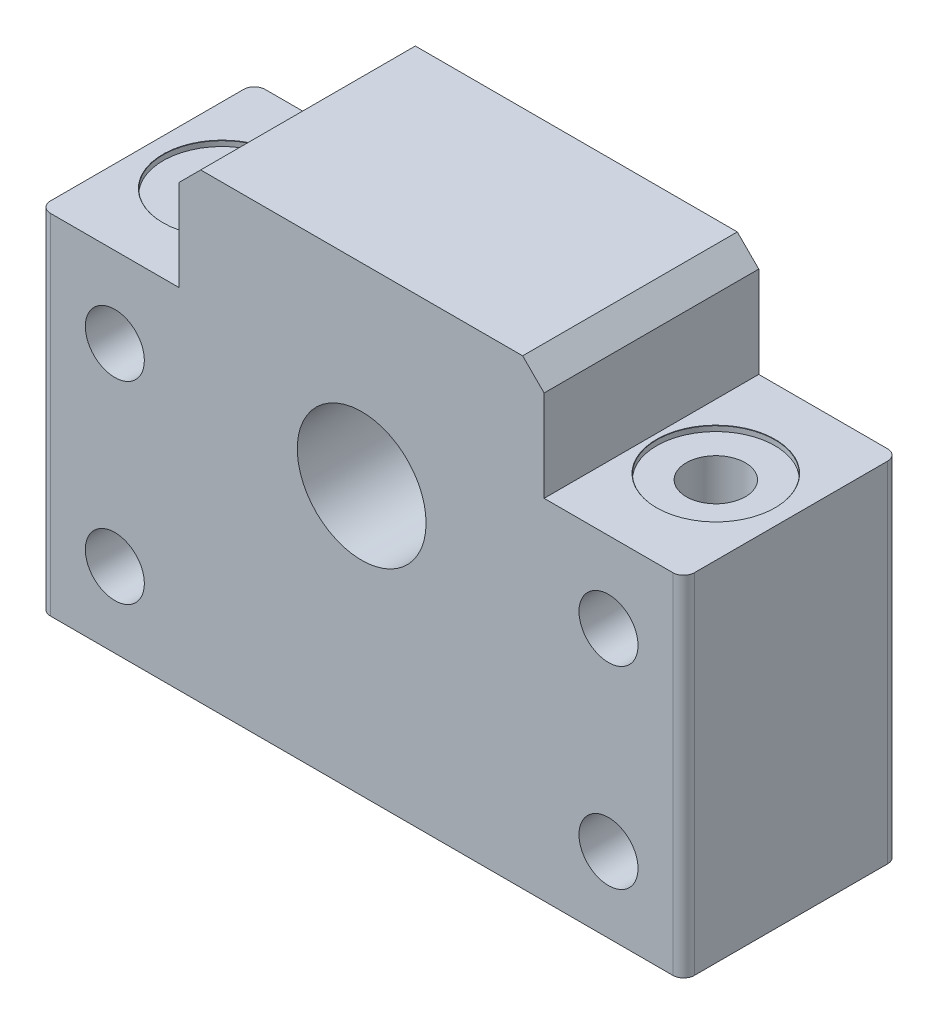
ISO-10303-21;
HEADER;
FILE_DESCRIPTION(('STEP AP214'),'2;1');
FILE_NAME('part.step','',(''),(''),'','','');
FILE_SCHEMA(('AUTOMOTIVE_DESIGN { 1 0 10303 214 1 1 1 1 }'));
ENDSEC;
DATA;
#1=APPLICATION_CONTEXT('core data for automotive mechanical design processes');
#2=APPLICATION_PROTOCOL_DEFINITION('international standard','automotive_design',2000,#1);
#3=PRODUCT_CONTEXT('',#1,'mechanical');
#4=PRODUCT('Part','Part','',(#3));
#5=PRODUCT_RELATED_PRODUCT_CATEGORY('part','',(#4));
#6=PRODUCT_DEFINITION_FORMATION('','',#4);
#7=PRODUCT_DEFINITION_CONTEXT('part definition',#1,'design');
#8=PRODUCT_DEFINITION('design','',#6,#7);
#9=PRODUCT_DEFINITION_SHAPE('','',#8);
#10=(LENGTH_UNIT() NAMED_UNIT(*) SI_UNIT(.MILLI.,.METRE.));
#11=(NAMED_UNIT(*) PLANE_ANGLE_UNIT() SI_UNIT($,.RADIAN.));
#12=(NAMED_UNIT(*) SI_UNIT($,.STERADIAN.) SOLID_ANGLE_UNIT());
#13=UNCERTAINTY_MEASURE_WITH_UNIT(LENGTH_MEASURE(1.E-05),#10,'distance_accuracy_value','');
#14=(GEOMETRIC_REPRESENTATION_CONTEXT(3) GLOBAL_UNCERTAINTY_ASSIGNED_CONTEXT((#13)) GLOBAL_UNIT_ASSIGNED_CONTEXT((#10,
#11,#12)) REPRESENTATION_CONTEXT('',''));
#15=CARTESIAN_POINT('',(0.,0.,0.));
#16=DIRECTION('',(0.,0.,1.));
#17=DIRECTION('',(1.,0.,0.));
#18=AXIS2_PLACEMENT_3D('',#15,#16,#17);
#19=CARTESIAN_POINT('',(23.,8.75,20.));
#20=DIRECTION('',(0.,0.,-1.));
#21=DIRECTION('',(-1.,0.,0.));
#22=AXIS2_PLACEMENT_3D('',#19,#20,#21);
#23=CYLINDRICAL_SURFACE('',#22,2.75);
#24=CARTESIAN_POINT('',(23.,8.75,9.99999999999999));
#25=DIRECTION('',(0.,0.707106781186547,-0.707106781186547));
#26=DIRECTION('',(0.,-0.707106781186547,-0.707106781186547));
#27=AXIS2_PLACEMENT_3D('',#24,#25,#26);
#28=ELLIPSE('',#27,3.88908729652601,2.75);
#29=CARTESIAN_POINT('',(25.75,8.75,9.99999999999999));
#30=VERTEX_POINT('',#29);
#31=CARTESIAN_POINT('',(20.25,8.75,9.99999999999999));
#32=VERTEX_POINT('',#31);
#33=EDGE_CURVE('E345',#30,#32,#28,.F.);
#34=ORIENTED_EDGE('',*,*,#33,.F.);
#35=CARTESIAN_POINT('',(23.,8.75,9.99999999999999));
#36=DIRECTION('',(0.,-0.707106781186547,-0.707106781186547));
#37=DIRECTION('',(0.,0.707106781186547,-0.707106781186547));
#38=AXIS2_PLACEMENT_3D('',#35,#36,#37);
#39=ELLIPSE('',#38,3.88908729652601,2.75);
#40=EDGE_CURVE('E48',#32,#30,#39,.F.);
#41=ORIENTED_EDGE('',*,*,#40,.F.);
#42=EDGE_LOOP('',(#34,#41));
#43=FACE_BOUND('',#42,.T.);
#44=CARTESIAN_POINT('',(23.,8.75,20.));
#45=DIRECTION('',(0.,0.,1.));
#46=DIRECTION('',(-1.,0.,0.));
#47=AXIS2_PLACEMENT_3D('',#44,#45,#46);
#48=CIRCLE('',#47,2.75);
#49=CARTESIAN_POINT('',(20.25,8.75,20.));
#50=VERTEX_POINT('',#49);
#51=EDGE_CURVE('E311',#50,#50,#48,.T.);
#52=ORIENTED_EDGE('',*,*,#51,.T.);
#53=EDGE_LOOP('',(#52));
#54=FACE_BOUND('',#53,.T.);
#55=ADVANCED_FACE('F34',(#43,#54),#23,.F.);
#56=CARTESIAN_POINT('',(23.,-9.25,20.));
#57=DIRECTION('',(0.,0.,-1.));
#58=DIRECTION('',(-1.,0.,0.));
#59=AXIS2_PLACEMENT_3D('',#56,#57,#58);
#60=CYLINDRICAL_SURFACE('',#59,2.75);
#61=CARTESIAN_POINT('',(23.,-9.25,9.99999999999999));
#62=DIRECTION('',(0.,0.707106781186547,-0.707106781186547));
#63=DIRECTION('',(0.,-0.707106781186547,-0.707106781186547));
#64=AXIS2_PLACEMENT_3D('',#61,#62,#63);
#65=ELLIPSE('',#64,3.88908729652601,2.75);
#66=CARTESIAN_POINT('',(25.75,-9.25,9.99999999999999));
#67=VERTEX_POINT('',#66);
#68=CARTESIAN_POINT('',(20.25,-9.25,9.99999999999999));
#69=VERTEX_POINT('',#68);
#70=EDGE_CURVE('E11',#67,#69,#65,.F.);
#71=ORIENTED_EDGE('',*,*,#70,.F.);
#72=CARTESIAN_POINT('',(23.,-9.25,9.99999999999999));
#73=DIRECTION('',(0.,-0.707106781186547,-0.707106781186547));
#74=DIRECTION('',(0.,0.707106781186547,-0.707106781186547));
#75=AXIS2_PLACEMENT_3D('',#72,#73,#74);
#76=ELLIPSE('',#75,3.88908729652601,2.75);
#77=EDGE_CURVE('E55',#69,#67,#76,.F.);
#78=ORIENTED_EDGE('',*,*,#77,.F.);
#79=EDGE_LOOP('',(#71,#78));
#80=FACE_BOUND('',#79,.T.);
#81=CARTESIAN_POINT('',(23.,-9.25,20.));
#82=DIRECTION('',(0.,0.,1.));
#83=DIRECTION('',(-1.,0.,0.));
#84=AXIS2_PLACEMENT_3D('',#81,#82,#83);
#85=CIRCLE('',#84,2.75);
#86=CARTESIAN_POINT('',(20.25,-9.25,20.));
#87=VERTEX_POINT('',#86);
#88=EDGE_CURVE('E305',#87,#87,#85,.T.);
#89=ORIENTED_EDGE('',*,*,#88,.T.);
#90=EDGE_LOOP('',(#89));
#91=FACE_BOUND('',#90,.T.);
#92=ADVANCED_FACE('F170',(#80,#91),#60,.F.);
#93=CARTESIAN_POINT('',(-23.,-9.25000000000001,20.));
#94=DIRECTION('',(0.,0.,-1.));
#95=DIRECTION('',(-1.,0.,0.));
#96=AXIS2_PLACEMENT_3D('',#93,#94,#95);
#97=CYLINDRICAL_SURFACE('',#96,2.75);
#98=CARTESIAN_POINT('',(-23.,-9.25000000000001,10.));
#99=DIRECTION('',(0.,0.707106781186547,-0.707106781186547));
#100=DIRECTION('',(0.,-0.707106781186547,-0.707106781186547));
#101=AXIS2_PLACEMENT_3D('',#98,#99,#100);
#102=ELLIPSE('',#101,3.88908729652601,2.75);
#103=CARTESIAN_POINT('',(-20.25,-9.25000000000001,10.));
#104=VERTEX_POINT('',#103);
#105=CARTESIAN_POINT('',(-25.75,-9.25000000000001,10.));
#106=VERTEX_POINT('',#105);
#107=EDGE_CURVE('E317',#104,#106,#102,.F.);
#108=ORIENTED_EDGE('',*,*,#107,.F.);
#109=CARTESIAN_POINT('',(-23.,-9.25000000000001,10.));
#110=DIRECTION('',(0.,-0.707106781186547,-0.707106781186547));
#111=DIRECTION('',(0.,0.707106781186547,-0.707106781186547));
#112=AXIS2_PLACEMENT_3D('',#109,#110,#111);
#113=ELLIPSE('',#112,3.88908729652601,2.75);
#114=EDGE_CURVE('E327',#106,#104,#113,.F.);
#115=ORIENTED_EDGE('',*,*,#114,.F.);
#116=EDGE_LOOP('',(#108,#115));
#117=FACE_BOUND('',#116,.T.);
#118=CARTESIAN_POINT('',(-23.,-9.25000000000001,20.));
#119=DIRECTION('',(0.,0.,1.));
#120=DIRECTION('',(1.,0.,0.));
#121=AXIS2_PLACEMENT_3D('',#118,#119,#120);
#122=CIRCLE('',#121,2.75);
#123=CARTESIAN_POINT('',(-20.25,-9.25000000000001,20.));
#124=VERTEX_POINT('',#123);
#125=EDGE_CURVE('E299',#124,#124,#122,.T.);
#126=ORIENTED_EDGE('',*,*,#125,.T.);
#127=EDGE_LOOP('',(#126));
#128=FACE_BOUND('',#127,.T.);
#129=ADVANCED_FACE('F431',(#117,#128),#97,.F.);
#130=CARTESIAN_POINT('',(-23.,8.74999999999999,20.));
#131=DIRECTION('',(0.,0.,-1.));
#132=DIRECTION('',(-1.,0.,0.));
#133=AXIS2_PLACEMENT_3D('',#130,#131,#132);
#134=CYLINDRICAL_SURFACE('',#133,2.75);
#135=CARTESIAN_POINT('',(-23.,8.74999999999999,10.));
#136=DIRECTION('',(0.,0.707106781186547,-0.707106781186547));
#137=DIRECTION('',(0.,-0.707106781186547,-0.707106781186547));
#138=AXIS2_PLACEMENT_3D('',#135,#136,#137);
#139=ELLIPSE('',#138,3.88908729652601,2.75);
#140=CARTESIAN_POINT('',(-20.25,8.74999999999999,10.));
#141=VERTEX_POINT('',#140);
#142=CARTESIAN_POINT('',(-25.75,8.74999999999999,10.));
#143=VERTEX_POINT('',#142);
#144=EDGE_CURVE('E168',#141,#143,#139,.F.);
#145=ORIENTED_EDGE('',*,*,#144,.F.);
#146=CARTESIAN_POINT('',(-23.,8.74999999999999,10.));
#147=DIRECTION('',(0.,-0.707106781186547,-0.707106781186547));
#148=DIRECTION('',(0.,0.707106781186547,-0.707106781186547));
#149=AXIS2_PLACEMENT_3D('',#146,#147,#148);
#150=ELLIPSE('',#149,3.88908729652601,2.75);
#151=EDGE_CURVE('E182',#143,#141,#150,.F.);
#152=ORIENTED_EDGE('',*,*,#151,.F.);
#153=EDGE_LOOP('',(#145,#152));
#154=FACE_BOUND('',#153,.T.);
#155=CARTESIAN_POINT('',(-23.,8.74999999999999,20.));
#156=DIRECTION('',(0.,0.,1.));
#157=DIRECTION('',(1.,0.,0.));
#158=AXIS2_PLACEMENT_3D('',#155,#156,#157);
#159=CIRCLE('',#158,2.75);
#160=CARTESIAN_POINT('',(-20.25,8.74999999999999,20.));
#161=VERTEX_POINT('',#160);
#162=EDGE_CURVE('E293',#161,#161,#159,.T.);
#163=ORIENTED_EDGE('',*,*,#162,.T.);
#164=EDGE_LOOP('',(#163));
#165=FACE_BOUND('',#164,.T.);
#166=ADVANCED_FACE('F458',(#154,#165),#134,.F.);
#167=CARTESIAN_POINT('',(0.,0.,20.));
#168=DIRECTION('',(0.,0.,1.));
#169=DIRECTION('',(1.,0.,0.));
#170=AXIS2_PLACEMENT_3D('',#167,#168,#169);
#171=PLANE('',#170);
#172=ORIENTED_EDGE('',*,*,#88,.F.);
#173=EDGE_LOOP('',(#172));
#174=FACE_BOUND('',#173,.T.);
#175=ORIENTED_EDGE('',*,*,#162,.F.);
#176=EDGE_LOOP('',(#175));
#177=FACE_BOUND('',#176,.T.);
#178=DIRECTION('',(-1.,0.,0.));
#179=VECTOR('',#178,1.);
#180=CARTESIAN_POINT('',(-30.,16.25,20.));
#181=LINE('',#180,#179);
#182=CARTESIAN_POINT('',(-17.,16.25,20.));
#183=VERTEX_POINT('',#182);
#184=CARTESIAN_POINT('',(-29.,16.25,20.));
#185=VERTEX_POINT('',#184);
#186=EDGE_CURVE('E278',#183,#185,#181,.T.);
#187=ORIENTED_EDGE('',*,*,#186,.T.);
#188=DIRECTION('',(0.,-1.,0.));
#189=VECTOR('',#188,1.);
#190=CARTESIAN_POINT('',(-29.,-16.25,20.));
#191=LINE('',#190,#189);
#192=CARTESIAN_POINT('',(-29.,-16.25,20.));
#193=VERTEX_POINT('',#192);
#194=EDGE_CURVE('E194',#185,#193,#191,.T.);
#195=ORIENTED_EDGE('',*,*,#194,.T.);
#196=DIRECTION('',(1.,0.,0.));
#197=VECTOR('',#196,1.);
#198=CARTESIAN_POINT('',(-30.,-16.25,20.));
#199=LINE('',#198,#197);
#200=CARTESIAN_POINT('',(29.,-16.25,20.));
#201=VERTEX_POINT('',#200);
#202=EDGE_CURVE('E257',#193,#201,#199,.T.);
#203=ORIENTED_EDGE('',*,*,#202,.T.);
#204=DIRECTION('',(0.,1.,0.));
#205=VECTOR('',#204,1.);
#206=CARTESIAN_POINT('',(29.,16.25,20.));
#207=LINE('',#206,#205);
#208=CARTESIAN_POINT('',(29.,16.25,20.));
#209=VERTEX_POINT('',#208);
#210=EDGE_CURVE('E197',#201,#209,#207,.T.);
#211=ORIENTED_EDGE('',*,*,#210,.T.);
#212=DIRECTION('',(-1.,0.,0.));
#213=VECTOR('',#212,1.);
#214=CARTESIAN_POINT('',(17.,16.25,20.));
#215=LINE('',#214,#213);
#216=CARTESIAN_POINT('',(17.,16.25,20.));
#217=VERTEX_POINT('',#216);
#218=EDGE_CURVE('E261',#209,#217,#215,.T.);
#219=ORIENTED_EDGE('',*,*,#218,.T.);
#220=DIRECTION('',(0.,1.,0.));
#221=VECTOR('',#220,1.);
#222=CARTESIAN_POINT('',(17.,26.75,20.));
#223=LINE('',#222,#221);
#224=CARTESIAN_POINT('',(17.,24.75,20.));
#225=VERTEX_POINT('',#224);
#226=EDGE_CURVE('E286',#217,#225,#223,.T.);
#227=ORIENTED_EDGE('',*,*,#226,.T.);
#228=DIRECTION('',(0.707106781186546,-0.707106781186549,0.));
#229=VECTOR('',#228,1.);
#230=CARTESIAN_POINT('',(20.875,20.875,20.));
#231=LINE('',#230,#229);
#232=CARTESIAN_POINT('',(15.,26.75,20.));
#233=VERTEX_POINT('',#232);
#234=EDGE_CURVE('E225',#225,#233,#231,.F.);
#235=ORIENTED_EDGE('',*,*,#234,.T.);
#236=DIRECTION('',(-1.,0.,0.));
#237=VECTOR('',#236,1.);
#238=CARTESIAN_POINT('',(-17.,26.75,20.));
#239=LINE('',#238,#237);
#240=CARTESIAN_POINT('',(-15.,26.75,20.));
#241=VERTEX_POINT('',#240);
#242=EDGE_CURVE('E283',#233,#241,#239,.T.);
#243=ORIENTED_EDGE('',*,*,#242,.T.);
#244=DIRECTION('',(0.707106781186549,0.707106781186546,0.));
#245=VECTOR('',#244,1.);
#246=CARTESIAN_POINT('',(-20.875,20.875,20.));
#247=LINE('',#246,#245);
#248=CARTESIAN_POINT('',(-17.,24.75,20.));
#249=VERTEX_POINT('',#248);
#250=EDGE_CURVE('E223',#241,#249,#247,.F.);
#251=ORIENTED_EDGE('',*,*,#250,.T.);
#252=DIRECTION('',(0.,-1.,0.));
#253=VECTOR('',#252,1.);
#254=CARTESIAN_POINT('',(-17.,16.25,20.));
#255=LINE('',#254,#253);
#256=EDGE_CURVE('E281',#249,#183,#255,.T.);
#257=ORIENTED_EDGE('',*,*,#256,.T.);
#258=EDGE_LOOP('',(#187,#195,#203,#211,#219,#227,#235,#243,#251,#257));
#259=FACE_BOUND('',#258,.T.);
#260=CARTESIAN_POINT('',(0.,8.74999999999999,20.));
#261=DIRECTION('',(0.,0.,1.));
#262=DIRECTION('',(1.,0.,0.));
#263=AXIS2_PLACEMENT_3D('',#260,#261,#262);
#264=CIRCLE('',#263,6.);
#265=CARTESIAN_POINT('',(6.,8.74999999999999,20.));
#266=VERTEX_POINT('',#265);
#267=EDGE_CURVE('E275',#266,#266,#264,.T.);
#268=ORIENTED_EDGE('',*,*,#267,.F.);
#269=EDGE_LOOP('',(#268));
#270=FACE_BOUND('',#269,.T.);
#271=ORIENTED_EDGE('',*,*,#125,.F.);
#272=EDGE_LOOP('',(#271));
#273=FACE_BOUND('',#272,.T.);
#274=ORIENTED_EDGE('',*,*,#51,.F.);
#275=EDGE_LOOP('',(#274));
#276=FACE_BOUND('',#275,.T.);
#277=ADVANCED_FACE('F391',(#174,#177,#259,#270,#273,#276),#171,.T.);
#278=CARTESIAN_POINT('',(0.,0.,0.));
#279=DIRECTION('',(0.,0.,1.));
#280=DIRECTION('',(1.,0.,0.));
#281=AXIS2_PLACEMENT_3D('',#278,#279,#280);
#282=PLANE('',#281);
#283=DIRECTION('',(1.,0.,0.));
#284=VECTOR('',#283,1.);
#285=CARTESIAN_POINT('',(-30.,-16.25,0.));
#286=LINE('',#285,#284);
#287=CARTESIAN_POINT('',(-29.,-16.25,0.));
#288=VERTEX_POINT('',#287);
#289=CARTESIAN_POINT('',(29.,-16.25,0.));
#290=VERTEX_POINT('',#289);
#291=EDGE_CURVE('E258',#288,#290,#286,.T.);
#292=ORIENTED_EDGE('',*,*,#291,.F.);
#293=DIRECTION('',(0.,-1.,0.));
#294=VECTOR('',#293,1.);
#295=CARTESIAN_POINT('',(-29.,0.,0.));
#296=LINE('',#295,#294);
#297=CARTESIAN_POINT('',(-29.,16.25,0.));
#298=VERTEX_POINT('',#297);
#299=EDGE_CURVE('E204',#288,#298,#296,.F.);
#300=ORIENTED_EDGE('',*,*,#299,.T.);
#301=DIRECTION('',(-1.,0.,0.));
#302=VECTOR('',#301,1.);
#303=CARTESIAN_POINT('',(-30.,16.25,0.));
#304=LINE('',#303,#302);
#305=CARTESIAN_POINT('',(-17.,16.25,0.));
#306=VERTEX_POINT('',#305);
#307=EDGE_CURVE('E262',#306,#298,#304,.T.);
#308=ORIENTED_EDGE('',*,*,#307,.F.);
#309=DIRECTION('',(0.,-1.,0.));
#310=VECTOR('',#309,1.);
#311=CARTESIAN_POINT('',(-17.,16.25,0.));
#312=LINE('',#311,#310);
#313=CARTESIAN_POINT('',(-17.,24.75,0.));
#314=VERTEX_POINT('',#313);
#315=EDGE_CURVE('E265',#314,#306,#312,.T.);
#316=ORIENTED_EDGE('',*,*,#315,.F.);
#317=DIRECTION('',(-0.707106781186549,-0.707106781186546,0.));
#318=VECTOR('',#317,1.);
#319=CARTESIAN_POINT('',(-17.,24.75,0.));
#320=LINE('',#319,#318);
#321=CARTESIAN_POINT('',(-15.,26.75,0.));
#322=VERTEX_POINT('',#321);
#323=EDGE_CURVE('E232',#314,#322,#320,.F.);
#324=ORIENTED_EDGE('',*,*,#323,.T.);
#325=DIRECTION('',(-1.,0.,0.));
#326=VECTOR('',#325,1.);
#327=CARTESIAN_POINT('',(-17.,26.75,0.));
#328=LINE('',#327,#326);
#329=CARTESIAN_POINT('',(15.,26.75,0.));
#330=VERTEX_POINT('',#329);
#331=EDGE_CURVE('E267',#330,#322,#328,.T.);
#332=ORIENTED_EDGE('',*,*,#331,.F.);
#333=DIRECTION('',(-0.707106781186546,0.707106781186549,0.));
#334=VECTOR('',#333,1.);
#335=CARTESIAN_POINT('',(15.,26.75,0.));
#336=LINE('',#335,#334);
#337=CARTESIAN_POINT('',(17.,24.75,0.));
#338=VERTEX_POINT('',#337);
#339=EDGE_CURVE('E234',#330,#338,#336,.F.);
#340=ORIENTED_EDGE('',*,*,#339,.T.);
#341=DIRECTION('',(0.,1.,0.));
#342=VECTOR('',#341,1.);
#343=CARTESIAN_POINT('',(17.,26.75,0.));
#344=LINE('',#343,#342);
#345=CARTESIAN_POINT('',(17.,16.25,0.));
#346=VERTEX_POINT('',#345);
#347=EDGE_CURVE('E270',#346,#338,#344,.T.);
#348=ORIENTED_EDGE('',*,*,#347,.F.);
#349=DIRECTION('',(-1.,0.,0.));
#350=VECTOR('',#349,1.);
#351=CARTESIAN_POINT('',(17.,16.25,0.));
#352=LINE('',#351,#350);
#353=CARTESIAN_POINT('',(29.,16.25,0.));
#354=VERTEX_POINT('',#353);
#355=EDGE_CURVE('E273',#354,#346,#352,.T.);
#356=ORIENTED_EDGE('',*,*,#355,.F.);
#357=DIRECTION('',(0.,1.,0.));
#358=VECTOR('',#357,1.);
#359=CARTESIAN_POINT('',(29.,0.,0.));
#360=LINE('',#359,#358);
#361=EDGE_CURVE('E206',#354,#290,#360,.F.);
#362=ORIENTED_EDGE('',*,*,#361,.T.);
#363=EDGE_LOOP('',(#292,#300,#308,#316,#324,#332,#340,#348,#356,#362));
#364=FACE_BOUND('',#363,.T.);
#365=CARTESIAN_POINT('',(0.,8.74999999999999,0.));
#366=DIRECTION('',(0.,0.,1.));
#367=DIRECTION('',(1.,0.,0.));
#368=AXIS2_PLACEMENT_3D('',#365,#366,#367);
#369=CIRCLE('',#368,6.);
#370=CARTESIAN_POINT('',(6.,8.74999999999999,0.));
#371=VERTEX_POINT('',#370);
#372=EDGE_CURVE('E290',#371,#371,#369,.T.);
#373=ORIENTED_EDGE('',*,*,#372,.T.);
#374=EDGE_LOOP('',(#373));
#375=FACE_BOUND('',#374,.T.);
#376=CARTESIAN_POINT('',(-23.,8.74999999999999,0.));
#377=DIRECTION('',(0.,0.,1.));
#378=DIRECTION('',(1.,0.,0.));
#379=AXIS2_PLACEMENT_3D('',#376,#377,#378);
#380=CIRCLE('',#379,2.75);
#381=CARTESIAN_POINT('',(-20.25,8.74999999999999,0.));
#382=VERTEX_POINT('',#381);
#383=EDGE_CURVE('E296',#382,#382,#380,.T.);
#384=ORIENTED_EDGE('',*,*,#383,.T.);
#385=EDGE_LOOP('',(#384));
#386=FACE_BOUND('',#385,.T.);
#387=CARTESIAN_POINT('',(-23.,-9.25000000000001,0.));
#388=DIRECTION('',(0.,0.,1.));
#389=DIRECTION('',(1.,0.,0.));
#390=AXIS2_PLACEMENT_3D('',#387,#388,#389);
#391=CIRCLE('',#390,2.75);
#392=CARTESIAN_POINT('',(-20.25,-9.25000000000001,0.));
#393=VERTEX_POINT('',#392);
#394=EDGE_CURVE('E302',#393,#393,#391,.T.);
#395=ORIENTED_EDGE('',*,*,#394,.T.);
#396=EDGE_LOOP('',(#395));
#397=FACE_BOUND('',#396,.T.);
#398=CARTESIAN_POINT('',(23.,-9.25,0.));
#399=DIRECTION('',(0.,0.,1.));
#400=DIRECTION('',(-1.,0.,0.));
#401=AXIS2_PLACEMENT_3D('',#398,#399,#400);
#402=CIRCLE('',#401,2.75);
#403=CARTESIAN_POINT('',(20.25,-9.25,0.));
#404=VERTEX_POINT('',#403);
#405=EDGE_CURVE('E308',#404,#404,#402,.T.);
#406=ORIENTED_EDGE('',*,*,#405,.T.);
#407=EDGE_LOOP('',(#406));
#408=FACE_BOUND('',#407,.T.);
#409=CARTESIAN_POINT('',(23.,8.75,0.));
#410=DIRECTION('',(0.,0.,1.));
#411=DIRECTION('',(-1.,0.,0.));
#412=AXIS2_PLACEMENT_3D('',#409,#410,#411);
#413=CIRCLE('',#412,2.75);
#414=CARTESIAN_POINT('',(20.25,8.75,0.));
#415=VERTEX_POINT('',#414);
#416=EDGE_CURVE('E314',#415,#415,#413,.T.);
#417=ORIENTED_EDGE('',*,*,#416,.T.);
#418=EDGE_LOOP('',(#417));
#419=FACE_BOUND('',#418,.T.);
#420=ADVANCED_FACE('F411',(#364,#375,#386,#397,#408,#419),#282,.F.);
#421=CARTESIAN_POINT('',(30.,16.25,20.));
#422=DIRECTION('',(-1.,0.,0.));
#423=DIRECTION('',(0.,-1.,0.));
#424=AXIS2_PLACEMENT_3D('',#421,#422,#423);
#425=PLANE('',#424);
#426=DIRECTION('',(0.,0.,-1.));
#427=VECTOR('',#426,1.);
#428=CARTESIAN_POINT('',(30.,-16.25,20.));
#429=LINE('',#428,#427);
#430=CARTESIAN_POINT('',(30.,-16.25,19.));
#431=VERTEX_POINT('',#430);
#432=CARTESIAN_POINT('',(30.,-16.25,1.));
#433=VERTEX_POINT('',#432);
#434=EDGE_CURVE('E254',#431,#433,#429,.T.);
#435=ORIENTED_EDGE('',*,*,#434,.T.);
#436=DIRECTION('',(0.,1.,0.));
#437=VECTOR('',#436,1.);
#438=CARTESIAN_POINT('',(30.,16.25,1.));
#439=LINE('',#438,#437);
#440=CARTESIAN_POINT('',(30.,16.25,1.));
#441=VERTEX_POINT('',#440);
#442=EDGE_CURVE('E189',#433,#441,#439,.T.);
#443=ORIENTED_EDGE('',*,*,#442,.T.);
#444=DIRECTION('',(0.,0.,-1.));
#445=VECTOR('',#444,1.);
#446=CARTESIAN_POINT('',(30.,16.25,20.));
#447=LINE('',#446,#445);
#448=CARTESIAN_POINT('',(30.,16.25,19.));
#449=VERTEX_POINT('',#448);
#450=EDGE_CURVE('E239',#449,#441,#447,.T.);
#451=ORIENTED_EDGE('',*,*,#450,.F.);
#452=DIRECTION('',(0.,1.,0.));
#453=VECTOR('',#452,1.);
#454=CARTESIAN_POINT('',(30.,-16.25,19.));
#455=LINE('',#454,#453);
#456=EDGE_CURVE('E192',#449,#431,#455,.F.);
#457=ORIENTED_EDGE('',*,*,#456,.T.);
#458=EDGE_LOOP('',(#435,#443,#451,#457));
#459=FACE_BOUND('',#458,.T.);
#460=ADVANCED_FACE('F375',(#459),#425,.F.);
#461=CARTESIAN_POINT('',(17.,16.25,20.));
#462=DIRECTION('',(0.,-1.,0.));
#463=DIRECTION('',(1.,0.,0.));
#464=AXIS2_PLACEMENT_3D('',#461,#462,#463);
#465=PLANE('',#464);
#466=CARTESIAN_POINT('',(23.,16.25,9.99999999999999));
#467=DIRECTION('',(0.,1.,0.));
#468=DIRECTION('',(0.,0.,1.));
#469=AXIS2_PLACEMENT_3D('',#466,#467,#468);
#470=CIRCLE('',#469,5.525);
#471=CARTESIAN_POINT('',(23.,16.25,15.525));
#472=VERTEX_POINT('',#471);
#473=EDGE_CURVE('E365',#472,#472,#470,.T.);
#474=ORIENTED_EDGE('',*,*,#473,.F.);
#475=EDGE_LOOP('',(#474));
#476=FACE_BOUND('',#475,.T.);
#477=ORIENTED_EDGE('',*,*,#450,.T.);
#478=CARTESIAN_POINT('',(29.,16.25,1.));
#479=DIRECTION('',(0.,-1.,0.));
#480=DIRECTION('',(1.,0.,0.));
#481=AXIS2_PLACEMENT_3D('',#478,#479,#480);
#482=CIRCLE('',#481,1.);
#483=EDGE_CURVE('E185',#441,#354,#482,.F.);
#484=ORIENTED_EDGE('',*,*,#483,.T.);
#485=ORIENTED_EDGE('',*,*,#355,.T.);
#486=DIRECTION('',(0.,0.,-1.));
#487=VECTOR('',#486,1.);
#488=CARTESIAN_POINT('',(17.,16.25,20.));
#489=LINE('',#488,#487);
#490=EDGE_CURVE('E242',#217,#346,#489,.T.);
#491=ORIENTED_EDGE('',*,*,#490,.F.);
#492=ORIENTED_EDGE('',*,*,#218,.F.);
#493=CARTESIAN_POINT('',(29.,16.25,19.));
#494=DIRECTION('',(0.,-1.,0.));
#495=DIRECTION('',(1.,0.,0.));
#496=AXIS2_PLACEMENT_3D('',#493,#494,#495);
#497=CIRCLE('',#496,1.);
#498=EDGE_CURVE('E187',#209,#449,#497,.F.);
#499=ORIENTED_EDGE('',*,*,#498,.T.);
#500=EDGE_LOOP('',(#477,#484,#485,#491,#492,#499));
#501=FACE_BOUND('',#500,.T.);
#502=ADVANCED_FACE('F371',(#476,#501),#465,.F.);
#503=CARTESIAN_POINT('',(17.,26.75,20.));
#504=DIRECTION('',(-1.,0.,0.));
#505=DIRECTION('',(0.,0.,1.));
#506=AXIS2_PLACEMENT_3D('',#503,#504,#505);
#507=PLANE('',#506);
#508=ORIENTED_EDGE('',*,*,#347,.T.);
#509=DIRECTION('',(0.,0.,1.));
#510=VECTOR('',#509,1.);
#511=CARTESIAN_POINT('',(17.,24.75,20.));
#512=LINE('',#511,#510);
#513=EDGE_CURVE('E221',#338,#225,#512,.T.);
#514=ORIENTED_EDGE('',*,*,#513,.T.);
#515=ORIENTED_EDGE('',*,*,#226,.F.);
#516=ORIENTED_EDGE('',*,*,#490,.T.);
#517=EDGE_LOOP('',(#508,#514,#515,#516));
#518=FACE_BOUND('',#517,.T.);
#519=ADVANCED_FACE('F374',(#518),#507,.F.);
#520=CARTESIAN_POINT('',(-17.,26.75,20.));
#521=DIRECTION('',(0.,-1.,0.));
#522=DIRECTION('',(1.,0.,0.));
#523=AXIS2_PLACEMENT_3D('',#520,#521,#522);
#524=PLANE('',#523);
#525=ORIENTED_EDGE('',*,*,#331,.T.);
#526=DIRECTION('',(0.,0.,1.));
#527=VECTOR('',#526,1.);
#528=CARTESIAN_POINT('',(-15.,26.75,20.));
#529=LINE('',#528,#527);
#530=EDGE_CURVE('E227',#322,#241,#529,.T.);
#531=ORIENTED_EDGE('',*,*,#530,.T.);
#532=ORIENTED_EDGE('',*,*,#242,.F.);
#533=DIRECTION('',(0.,0.,-1.));
#534=VECTOR('',#533,1.);
#535=CARTESIAN_POINT('',(15.,26.75,20.));
#536=LINE('',#535,#534);
#537=EDGE_CURVE('E229',#233,#330,#536,.T.);
#538=ORIENTED_EDGE('',*,*,#537,.T.);
#539=EDGE_LOOP('',(#525,#531,#532,#538));
#540=FACE_BOUND('',#539,.T.);
#541=ADVANCED_FACE('F476',(#540),#524,.F.);
#542=CARTESIAN_POINT('',(-17.,16.25,20.));
#543=DIRECTION('',(1.,0.,0.));
#544=DIRECTION('',(0.,0.,-1.));
#545=AXIS2_PLACEMENT_3D('',#542,#543,#544);
#546=PLANE('',#545);
#547=ORIENTED_EDGE('',*,*,#256,.F.);
#548=DIRECTION('',(0.,0.,-1.));
#549=VECTOR('',#548,1.);
#550=CARTESIAN_POINT('',(-17.,24.75,20.));
#551=LINE('',#550,#549);
#552=EDGE_CURVE('E236',#249,#314,#551,.T.);
#553=ORIENTED_EDGE('',*,*,#552,.T.);
#554=ORIENTED_EDGE('',*,*,#315,.T.);
#555=DIRECTION('',(0.,0.,-1.));
#556=VECTOR('',#555,1.);
#557=CARTESIAN_POINT('',(-17.,16.25,20.));
#558=LINE('',#557,#556);
#559=EDGE_CURVE('E245',#183,#306,#558,.T.);
#560=ORIENTED_EDGE('',*,*,#559,.F.);
#561=EDGE_LOOP('',(#547,#553,#554,#560));
#562=FACE_BOUND('',#561,.T.);
#563=ADVANCED_FACE('F472',(#562),#546,.F.);
#564=CARTESIAN_POINT('',(-30.,16.25,20.));
#565=DIRECTION('',(0.,-1.,0.));
#566=DIRECTION('',(0.,0.,-1.));
#567=AXIS2_PLACEMENT_3D('',#564,#565,#566);
#568=PLANE('',#567);
#569=CARTESIAN_POINT('',(-23.,16.25,10.));
#570=DIRECTION('',(0.,1.,0.));
#571=DIRECTION('',(0.,0.,1.));
#572=AXIS2_PLACEMENT_3D('',#569,#570,#571);
#573=CIRCLE('',#572,5.525);
#574=CARTESIAN_POINT('',(-23.,16.25,15.525));
#575=VERTEX_POINT('',#574);
#576=EDGE_CURVE('E342',#575,#575,#573,.T.);
#577=ORIENTED_EDGE('',*,*,#576,.F.);
#578=EDGE_LOOP('',(#577));
#579=FACE_BOUND('',#578,.T.);
#580=ORIENTED_EDGE('',*,*,#307,.T.);
#581=CARTESIAN_POINT('',(-29.,16.25,1.));
#582=DIRECTION('',(0.,-1.,0.));
#583=DIRECTION('',(0.,0.,-1.));
#584=AXIS2_PLACEMENT_3D('',#581,#582,#583);
#585=CIRCLE('',#584,1.);
#586=CARTESIAN_POINT('',(-30.,16.25,1.));
#587=VERTEX_POINT('',#586);
#588=EDGE_CURVE('E200',#298,#587,#585,.F.);
#589=ORIENTED_EDGE('',*,*,#588,.T.);
#590=DIRECTION('',(0.,0.,-1.));
#591=VECTOR('',#590,1.);
#592=CARTESIAN_POINT('',(-30.,16.25,20.));
#593=LINE('',#592,#591);
#594=CARTESIAN_POINT('',(-30.,16.25,19.));
#595=VERTEX_POINT('',#594);
#596=EDGE_CURVE('E248',#595,#587,#593,.T.);
#597=ORIENTED_EDGE('',*,*,#596,.F.);
#598=CARTESIAN_POINT('',(-29.,16.25,19.));
#599=DIRECTION('',(0.,-1.,0.));
#600=DIRECTION('',(0.,0.,-1.));
#601=AXIS2_PLACEMENT_3D('',#598,#599,#600);
#602=CIRCLE('',#601,1.);
#603=EDGE_CURVE('E202',#595,#185,#602,.F.);
#604=ORIENTED_EDGE('',*,*,#603,.T.);
#605=ORIENTED_EDGE('',*,*,#186,.F.);
#606=ORIENTED_EDGE('',*,*,#559,.T.);
#607=EDGE_LOOP('',(#580,#589,#597,#604,#605,#606));
#608=FACE_BOUND('',#607,.T.);
#609=ADVANCED_FACE('F469',(#579,#608),#568,.F.);
#610=CARTESIAN_POINT('',(-30.,16.25,20.));
#611=DIRECTION('',(1.,0.,0.));
#612=DIRECTION('',(0.,1.,0.));
#613=AXIS2_PLACEMENT_3D('',#610,#611,#612);
#614=PLANE('',#613);
#615=ORIENTED_EDGE('',*,*,#596,.T.);
#616=DIRECTION('',(0.,-1.,0.));
#617=VECTOR('',#616,1.);
#618=CARTESIAN_POINT('',(-30.,16.25,1.));
#619=LINE('',#618,#617);
#620=CARTESIAN_POINT('',(-30.,-16.25,1.));
#621=VERTEX_POINT('',#620);
#622=EDGE_CURVE('E216',#587,#621,#619,.T.);
#623=ORIENTED_EDGE('',*,*,#622,.T.);
#624=DIRECTION('',(0.,0.,-1.));
#625=VECTOR('',#624,1.);
#626=CARTESIAN_POINT('',(-30.,-16.25,20.));
#627=LINE('',#626,#625);
#628=CARTESIAN_POINT('',(-30.,-16.25,19.));
#629=VERTEX_POINT('',#628);
#630=EDGE_CURVE('E251',#629,#621,#627,.T.);
#631=ORIENTED_EDGE('',*,*,#630,.F.);
#632=DIRECTION('',(0.,-1.,0.));
#633=VECTOR('',#632,1.);
#634=CARTESIAN_POINT('',(-30.,16.25,19.));
#635=LINE('',#634,#633);
#636=EDGE_CURVE('E219',#629,#595,#635,.F.);
#637=ORIENTED_EDGE('',*,*,#636,.T.);
#638=EDGE_LOOP('',(#615,#623,#631,#637));
#639=FACE_BOUND('',#638,.T.);
#640=ADVANCED_FACE('F401',(#639),#614,.F.);
#641=CARTESIAN_POINT('',(-30.,-16.25,20.));
#642=DIRECTION('',(0.,1.,0.));
#643=DIRECTION('',(0.,0.,1.));
#644=AXIS2_PLACEMENT_3D('',#641,#642,#643);
#645=PLANE('',#644);
#646=CARTESIAN_POINT('',(23.,-16.25,9.99999999999999));
#647=DIRECTION('',(0.,1.,0.));
#648=DIRECTION('',(0.,0.,1.));
#649=AXIS2_PLACEMENT_3D('',#646,#647,#648);
#650=CIRCLE('',#649,2.74999999999999);
#651=CARTESIAN_POINT('',(23.,-16.25,12.75));
#652=VERTEX_POINT('',#651);
#653=EDGE_CURVE('E353',#652,#652,#650,.T.);
#654=ORIENTED_EDGE('',*,*,#653,.T.);
#655=EDGE_LOOP('',(#654));
#656=FACE_BOUND('',#655,.T.);
#657=CARTESIAN_POINT('',(-23.,-16.25,10.));
#658=DIRECTION('',(0.,1.,0.));
#659=DIRECTION('',(0.,0.,1.));
#660=AXIS2_PLACEMENT_3D('',#657,#658,#659);
#661=CIRCLE('',#660,2.74999999999999);
#662=CARTESIAN_POINT('',(-23.,-16.25,12.75));
#663=VERTEX_POINT('',#662);
#664=EDGE_CURVE('E330',#663,#663,#661,.T.);
#665=ORIENTED_EDGE('',*,*,#664,.T.);
#666=EDGE_LOOP('',(#665));
#667=FACE_BOUND('',#666,.T.);
#668=ORIENTED_EDGE('',*,*,#630,.T.);
#669=CARTESIAN_POINT('',(-29.,-16.25,1.));
#670=DIRECTION('',(0.,1.,0.));
#671=DIRECTION('',(0.,0.,1.));
#672=AXIS2_PLACEMENT_3D('',#669,#670,#671);
#673=CIRCLE('',#672,1.);
#674=EDGE_CURVE('E208',#621,#288,#673,.F.);
#675=ORIENTED_EDGE('',*,*,#674,.T.);
#676=ORIENTED_EDGE('',*,*,#291,.T.);
#677=CARTESIAN_POINT('',(29.,-16.25,1.));
#678=DIRECTION('',(0.,1.,0.));
#679=DIRECTION('',(0.,0.,1.));
#680=AXIS2_PLACEMENT_3D('',#677,#678,#679);
#681=CIRCLE('',#680,1.);
#682=EDGE_CURVE('E212',#290,#433,#681,.F.);
#683=ORIENTED_EDGE('',*,*,#682,.T.);
#684=ORIENTED_EDGE('',*,*,#434,.F.);
#685=CARTESIAN_POINT('',(29.,-16.25,19.));
#686=DIRECTION('',(0.,1.,0.));
#687=DIRECTION('',(0.,0.,1.));
#688=AXIS2_PLACEMENT_3D('',#685,#686,#687);
#689=CIRCLE('',#688,1.);
#690=EDGE_CURVE('E214',#431,#201,#689,.F.);
#691=ORIENTED_EDGE('',*,*,#690,.T.);
#692=ORIENTED_EDGE('',*,*,#202,.F.);
#693=CARTESIAN_POINT('',(-29.,-16.25,19.));
#694=DIRECTION('',(0.,1.,0.));
#695=DIRECTION('',(0.,0.,1.));
#696=AXIS2_PLACEMENT_3D('',#693,#694,#695);
#697=CIRCLE('',#696,1.);
#698=EDGE_CURVE('E210',#193,#629,#697,.F.);
#699=ORIENTED_EDGE('',*,*,#698,.T.);
#700=EDGE_LOOP('',(#668,#675,#676,#683,#684,#691,#692,#699));
#701=FACE_BOUND('',#700,.T.);
#702=ADVANCED_FACE('F389',(#656,#667,#701),#645,.F.);
#703=CARTESIAN_POINT('',(0.,8.74999999999999,20.));
#704=DIRECTION('',(0.,0.,-1.));
#705=DIRECTION('',(-1.,0.,0.));
#706=AXIS2_PLACEMENT_3D('',#703,#704,#705);
#707=CYLINDRICAL_SURFACE('',#706,6.);
#708=ORIENTED_EDGE('',*,*,#267,.T.);
#709=EDGE_LOOP('',(#708));
#710=FACE_BOUND('',#709,.T.);
#711=ORIENTED_EDGE('',*,*,#372,.F.);
#712=EDGE_LOOP('',(#711));
#713=FACE_BOUND('',#712,.T.);
#714=ADVANCED_FACE('F465',(#710,#713),#707,.F.);
#715=CARTESIAN_POINT('',(-23.,8.74999999999999,10.));
#716=DIRECTION('',(0.,0.707106781186547,-0.707106781186547));
#717=DIRECTION('',(0.,-0.707106781186547,-0.707106781186547));
#718=AXIS2_PLACEMENT_3D('',#715,#716,#717);
#719=ELLIPSE('',#718,3.88908729652601,2.75);
#720=EDGE_CURVE('E177',#141,#143,#719,.T.);
#721=ORIENTED_EDGE('',*,*,#720,.F.);
#722=CARTESIAN_POINT('',(-23.,8.74999999999999,10.));
#723=DIRECTION('',(0.,-0.707106781186547,-0.707106781186547));
#724=DIRECTION('',(0.,0.707106781186547,-0.707106781186547));
#725=AXIS2_PLACEMENT_3D('',#722,#723,#724);
#726=ELLIPSE('',#725,3.88908729652601,2.75);
#727=EDGE_CURVE('E180',#143,#141,#726,.T.);
#728=ORIENTED_EDGE('',*,*,#727,.F.);
#729=EDGE_LOOP('',(#721,#728));
#730=FACE_BOUND('',#729,.T.);
#731=ORIENTED_EDGE('',*,*,#383,.F.);
#732=EDGE_LOOP('',(#731));
#733=FACE_BOUND('',#732,.T.);
#734=ADVANCED_FACE('F539',(#730,#733),#134,.F.);
#735=CARTESIAN_POINT('',(-23.,-9.25000000000001,10.));
#736=DIRECTION('',(0.,0.707106781186547,-0.707106781186547));
#737=DIRECTION('',(0.,-0.707106781186547,-0.707106781186547));
#738=AXIS2_PLACEMENT_3D('',#735,#736,#737);
#739=ELLIPSE('',#738,3.88908729652601,2.75);
#740=EDGE_CURVE('E322',#104,#106,#739,.T.);
#741=ORIENTED_EDGE('',*,*,#740,.F.);
#742=CARTESIAN_POINT('',(-23.,-9.25000000000001,10.));
#743=DIRECTION('',(0.,-0.707106781186547,-0.707106781186547));
#744=DIRECTION('',(0.,0.707106781186547,-0.707106781186547));
#745=AXIS2_PLACEMENT_3D('',#742,#743,#744);
#746=ELLIPSE('',#745,3.88908729652601,2.75);
#747=EDGE_CURVE('E325',#106,#104,#746,.T.);
#748=ORIENTED_EDGE('',*,*,#747,.F.);
#749=EDGE_LOOP('',(#741,#748));
#750=FACE_BOUND('',#749,.T.);
#751=ORIENTED_EDGE('',*,*,#394,.F.);
#752=EDGE_LOOP('',(#751));
#753=FACE_BOUND('',#752,.T.);
#754=ADVANCED_FACE('F445',(#750,#753),#97,.F.);
#755=CARTESIAN_POINT('',(23.,-9.25,9.99999999999999));
#756=DIRECTION('',(0.,0.707106781186547,-0.707106781186547));
#757=DIRECTION('',(0.,-0.707106781186547,-0.707106781186547));
#758=AXIS2_PLACEMENT_3D('',#755,#756,#757);
#759=ELLIPSE('',#758,3.88908729652601,2.75);
#760=EDGE_CURVE('E42',#67,#69,#759,.T.);
#761=ORIENTED_EDGE('',*,*,#760,.F.);
#762=CARTESIAN_POINT('',(23.,-9.25,9.99999999999999));
#763=DIRECTION('',(0.,-0.707106781186547,-0.707106781186547));
#764=DIRECTION('',(0.,0.707106781186547,-0.707106781186547));
#765=AXIS2_PLACEMENT_3D('',#762,#763,#764);
#766=ELLIPSE('',#765,3.88908729652601,2.75);
#767=EDGE_CURVE('E160',#69,#67,#766,.T.);
#768=ORIENTED_EDGE('',*,*,#767,.F.);
#769=EDGE_LOOP('',(#761,#768));
#770=FACE_BOUND('',#769,.T.);
#771=ORIENTED_EDGE('',*,*,#405,.F.);
#772=EDGE_LOOP('',(#771));
#773=FACE_BOUND('',#772,.T.);
#774=ADVANCED_FACE('F172',(#770,#773),#60,.F.);
#775=CARTESIAN_POINT('',(23.,8.75,9.99999999999999));
#776=DIRECTION('',(0.,0.707106781186547,-0.707106781186547));
#777=DIRECTION('',(0.,-0.707106781186547,-0.707106781186547));
#778=AXIS2_PLACEMENT_3D('',#775,#776,#777);
#779=ELLIPSE('',#778,3.88908729652601,2.75);
#780=EDGE_CURVE('E348',#30,#32,#779,.T.);
#781=ORIENTED_EDGE('',*,*,#780,.F.);
#782=CARTESIAN_POINT('',(23.,8.75,9.99999999999999));
#783=DIRECTION('',(0.,-0.707106781186547,-0.707106781186547));
#784=DIRECTION('',(0.,0.707106781186547,-0.707106781186547));
#785=AXIS2_PLACEMENT_3D('',#782,#783,#784);
#786=ELLIPSE('',#785,3.88908729652601,2.75);
#787=EDGE_CURVE('E350',#32,#30,#786,.T.);
#788=ORIENTED_EDGE('',*,*,#787,.F.);
#789=EDGE_LOOP('',(#781,#788));
#790=FACE_BOUND('',#789,.T.);
#791=ORIENTED_EDGE('',*,*,#416,.F.);
#792=EDGE_LOOP('',(#791));
#793=FACE_BOUND('',#792,.T.);
#794=ADVANCED_FACE('F427',(#790,#793),#23,.F.);
#795=CARTESIAN_POINT('',(-17.,24.75,20.));
#796=DIRECTION('',(0.707106781186546,-0.707106781186549,0.));
#797=DIRECTION('',(0.,0.,-1.));
#798=AXIS2_PLACEMENT_3D('',#795,#796,#797);
#799=PLANE('',#798);
#800=ORIENTED_EDGE('',*,*,#250,.F.);
#801=ORIENTED_EDGE('',*,*,#530,.F.);
#802=ORIENTED_EDGE('',*,*,#323,.F.);
#803=ORIENTED_EDGE('',*,*,#552,.F.);
#804=EDGE_LOOP('',(#800,#801,#802,#803));
#805=FACE_BOUND('',#804,.T.);
#806=ADVANCED_FACE('F436',(#805),#799,.F.);
#807=CARTESIAN_POINT('',(15.,26.75,20.));
#808=DIRECTION('',(-0.707106781186549,-0.707106781186546,0.));
#809=DIRECTION('',(0.,0.,-1.));
#810=AXIS2_PLACEMENT_3D('',#807,#808,#809);
#811=PLANE('',#810);
#812=ORIENTED_EDGE('',*,*,#234,.F.);
#813=ORIENTED_EDGE('',*,*,#513,.F.);
#814=ORIENTED_EDGE('',*,*,#339,.F.);
#815=ORIENTED_EDGE('',*,*,#537,.F.);
#816=EDGE_LOOP('',(#812,#813,#814,#815));
#817=FACE_BOUND('',#816,.T.);
#818=ADVANCED_FACE('F442',(#817),#811,.F.);
#819=CARTESIAN_POINT('',(-29.,16.25,1.));
#820=DIRECTION('',(0.,-1.,0.));
#821=DIRECTION('',(1.,0.,0.));
#822=AXIS2_PLACEMENT_3D('',#819,#820,#821);
#823=CYLINDRICAL_SURFACE('',#822,1.);
#824=ORIENTED_EDGE('',*,*,#588,.F.);
#825=ORIENTED_EDGE('',*,*,#299,.F.);
#826=ORIENTED_EDGE('',*,*,#674,.F.);
#827=ORIENTED_EDGE('',*,*,#622,.F.);
#828=EDGE_LOOP('',(#824,#825,#826,#827));
#829=FACE_BOUND('',#828,.T.);
#830=ADVANCED_FACE('F406',(#829),#823,.T.);
#831=CARTESIAN_POINT('',(-29.,0.,19.));
#832=DIRECTION('',(0.,1.,0.));
#833=DIRECTION('',(-1.,0.,0.));
#834=AXIS2_PLACEMENT_3D('',#831,#832,#833);
#835=CYLINDRICAL_SURFACE('',#834,1.);
#836=ORIENTED_EDGE('',*,*,#603,.F.);
#837=ORIENTED_EDGE('',*,*,#636,.F.);
#838=ORIENTED_EDGE('',*,*,#698,.F.);
#839=ORIENTED_EDGE('',*,*,#194,.F.);
#840=EDGE_LOOP('',(#836,#837,#838,#839));
#841=FACE_BOUND('',#840,.T.);
#842=ADVANCED_FACE('F397',(#841),#835,.T.);
#843=CARTESIAN_POINT('',(29.,16.25,1.));
#844=DIRECTION('',(0.,1.,0.));
#845=DIRECTION('',(-1.,0.,0.));
#846=AXIS2_PLACEMENT_3D('',#843,#844,#845);
#847=CYLINDRICAL_SURFACE('',#846,1.);
#848=ORIENTED_EDGE('',*,*,#682,.F.);
#849=ORIENTED_EDGE('',*,*,#361,.F.);
#850=ORIENTED_EDGE('',*,*,#483,.F.);
#851=ORIENTED_EDGE('',*,*,#442,.F.);
#852=EDGE_LOOP('',(#848,#849,#850,#851));
#853=FACE_BOUND('',#852,.T.);
#854=ADVANCED_FACE('F417',(#853),#847,.T.);
#855=CARTESIAN_POINT('',(29.,0.,19.));
#856=DIRECTION('',(0.,-1.,0.));
#857=DIRECTION('',(1.,0.,0.));
#858=AXIS2_PLACEMENT_3D('',#855,#856,#857);
#859=CYLINDRICAL_SURFACE('',#858,1.);
#860=ORIENTED_EDGE('',*,*,#690,.F.);
#861=ORIENTED_EDGE('',*,*,#456,.F.);
#862=ORIENTED_EDGE('',*,*,#498,.F.);
#863=ORIENTED_EDGE('',*,*,#210,.F.);
#864=EDGE_LOOP('',(#860,#861,#862,#863));
#865=FACE_BOUND('',#864,.T.);
#866=ADVANCED_FACE('F36',(#865),#859,.T.);
#867=CARTESIAN_POINT('',(-23.,16.25,10.));
#868=DIRECTION('',(0.,1.,0.));
#869=DIRECTION('',(0.,0.,1.));
#870=AXIS2_PLACEMENT_3D('',#867,#868,#869);
#871=CYLINDRICAL_SURFACE('',#870,2.75);
#872=ORIENTED_EDGE('',*,*,#107,.T.);
#873=ORIENTED_EDGE('',*,*,#747,.T.);
#874=EDGE_LOOP('',(#872,#873));
#875=FACE_BOUND('',#874,.T.);
#876=ORIENTED_EDGE('',*,*,#720,.T.);
#877=ORIENTED_EDGE('',*,*,#151,.T.);
#878=EDGE_LOOP('',(#876,#877));
#879=FACE_BOUND('',#878,.T.);
#880=ADVANCED_FACE('F423',(#875,#879),#871,.F.);
#881=CARTESIAN_POINT('',(-23.,16.25,10.));
#882=DIRECTION('',(0.,1.,0.));
#883=DIRECTION('',(0.,0.,1.));
#884=AXIS2_PLACEMENT_3D('',#881,#882,#883);
#885=CONICAL_SURFACE('',#884,5.525,0.785398163397379);
#886=CARTESIAN_POINT('',(-23.,16.225,10.));
#887=DIRECTION('',(0.,1.,0.));
#888=DIRECTION('',(0.,0.,1.));
#889=AXIS2_PLACEMENT_3D('',#886,#887,#888);
#890=CIRCLE('',#889,5.49999999999999);
#891=CARTESIAN_POINT('',(-23.,16.225,15.5));
#892=VERTEX_POINT('',#891);
#893=EDGE_CURVE('E339',#892,#892,#890,.T.);
#894=ORIENTED_EDGE('',*,*,#893,.F.);
#895=EDGE_LOOP('',(#894));
#896=FACE_BOUND('',#895,.T.);
#897=ORIENTED_EDGE('',*,*,#576,.T.);
#898=EDGE_LOOP('',(#897));
#899=FACE_BOUND('',#898,.T.);
#900=ADVANCED_FACE('F596',(#896,#899),#885,.F.);
#901=CARTESIAN_POINT('',(-23.,16.25,10.));
#902=DIRECTION('',(0.,1.,0.));
#903=DIRECTION('',(0.,0.,1.));
#904=AXIS2_PLACEMENT_3D('',#901,#902,#903);
#905=CYLINDRICAL_SURFACE('',#904,5.49999999999999);
#906=CARTESIAN_POINT('',(-23.,15.75,10.));
#907=DIRECTION('',(0.,1.,0.));
#908=DIRECTION('',(0.,0.,1.));
#909=AXIS2_PLACEMENT_3D('',#906,#907,#908);
#910=CIRCLE('',#909,5.49999999999999);
#911=CARTESIAN_POINT('',(-23.,15.75,15.5));
#912=VERTEX_POINT('',#911);
#913=EDGE_CURVE('E336',#912,#912,#910,.T.);
#914=ORIENTED_EDGE('',*,*,#913,.F.);
#915=EDGE_LOOP('',(#914));
#916=FACE_BOUND('',#915,.T.);
#917=ORIENTED_EDGE('',*,*,#893,.T.);
#918=EDGE_LOOP('',(#917));
#919=FACE_BOUND('',#918,.T.);
#920=ADVANCED_FACE('F607',(#916,#919),#905,.F.);
#921=CARTESIAN_POINT('',(-17.5,15.75,10.));
#922=DIRECTION('',(0.,-1.,0.));
#923=DIRECTION('',(0.,0.,-1.));
#924=AXIS2_PLACEMENT_3D('',#921,#922,#923);
#925=PLANE('',#924);
#926=CARTESIAN_POINT('',(-23.,15.75,10.));
#927=DIRECTION('',(0.,1.,0.));
#928=DIRECTION('',(0.,0.,1.));
#929=AXIS2_PLACEMENT_3D('',#926,#927,#928);
#930=CIRCLE('',#929,2.75000000000001);
#931=CARTESIAN_POINT('',(-23.,15.75,12.75));
#932=VERTEX_POINT('',#931);
#933=EDGE_CURVE('E333',#932,#932,#930,.T.);
#934=ORIENTED_EDGE('',*,*,#933,.F.);
#935=EDGE_LOOP('',(#934));
#936=FACE_BOUND('',#935,.T.);
#937=ORIENTED_EDGE('',*,*,#913,.T.);
#938=EDGE_LOOP('',(#937));
#939=FACE_BOUND('',#938,.T.);
#940=ADVANCED_FACE('F617',(#936,#939),#925,.F.);
#941=ORIENTED_EDGE('',*,*,#144,.T.);
#942=ORIENTED_EDGE('',*,*,#727,.T.);
#943=EDGE_LOOP('',(#941,#942));
#944=FACE_BOUND('',#943,.T.);
#945=ORIENTED_EDGE('',*,*,#933,.T.);
#946=EDGE_LOOP('',(#945));
#947=FACE_BOUND('',#946,.T.);
#948=ADVANCED_FACE('F598',(#944,#947),#871,.F.);
#949=ORIENTED_EDGE('',*,*,#740,.T.);
#950=ORIENTED_EDGE('',*,*,#114,.T.);
#951=EDGE_LOOP('',(#949,#950));
#952=FACE_BOUND('',#951,.T.);
#953=ORIENTED_EDGE('',*,*,#664,.F.);
#954=EDGE_LOOP('',(#953));
#955=FACE_BOUND('',#954,.T.);
#956=ADVANCED_FACE('F599',(#952,#955),#871,.F.);
#957=CARTESIAN_POINT('',(23.,16.25,9.99999999999999));
#958=DIRECTION('',(0.,1.,0.));
#959=DIRECTION('',(0.,0.,1.));
#960=AXIS2_PLACEMENT_3D('',#957,#958,#959);
#961=CYLINDRICAL_SURFACE('',#960,2.75);
#962=ORIENTED_EDGE('',*,*,#760,.T.);
#963=ORIENTED_EDGE('',*,*,#77,.T.);
#964=EDGE_LOOP('',(#962,#963));
#965=FACE_BOUND('',#964,.T.);
#966=ORIENTED_EDGE('',*,*,#653,.F.);
#967=EDGE_LOOP('',(#966));
#968=FACE_BOUND('',#967,.T.);
#969=ADVANCED_FACE('F166',(#965,#968),#961,.F.);
#970=ORIENTED_EDGE('',*,*,#780,.T.);
#971=ORIENTED_EDGE('',*,*,#40,.T.);
#972=EDGE_LOOP('',(#970,#971));
#973=FACE_BOUND('',#972,.T.);
#974=ORIENTED_EDGE('',*,*,#70,.T.);
#975=ORIENTED_EDGE('',*,*,#767,.T.);
#976=EDGE_LOOP('',(#974,#975));
#977=FACE_BOUND('',#976,.T.);
#978=ADVANCED_FACE('F161',(#973,#977),#961,.F.);
#979=ORIENTED_EDGE('',*,*,#33,.T.);
#980=ORIENTED_EDGE('',*,*,#787,.T.);
#981=EDGE_LOOP('',(#979,#980));
#982=FACE_BOUND('',#981,.T.);
#983=CARTESIAN_POINT('',(23.,15.75,9.99999999999999));
#984=DIRECTION('',(0.,1.,0.));
#985=DIRECTION('',(0.,0.,1.));
#986=AXIS2_PLACEMENT_3D('',#983,#984,#985);
#987=CIRCLE('',#986,2.75000000000001);
#988=CARTESIAN_POINT('',(23.,15.75,12.75));
#989=VERTEX_POINT('',#988);
#990=EDGE_CURVE('E356',#989,#989,#987,.T.);
#991=ORIENTED_EDGE('',*,*,#990,.T.);
#992=EDGE_LOOP('',(#991));
#993=FACE_BOUND('',#992,.T.);
#994=ADVANCED_FACE('F653',(#982,#993),#961,.F.);
#995=CARTESIAN_POINT('',(28.5,15.75,9.99999999999999));
#996=DIRECTION('',(0.,-1.,0.));
#997=DIRECTION('',(0.,0.,-1.));
#998=AXIS2_PLACEMENT_3D('',#995,#996,#997);
#999=PLANE('',#998);
#1000=ORIENTED_EDGE('',*,*,#990,.F.);
#1001=EDGE_LOOP('',(#1000));
#1002=FACE_BOUND('',#1001,.T.);
#1003=CARTESIAN_POINT('',(23.,15.75,9.99999999999999));
#1004=DIRECTION('',(0.,1.,0.));
#1005=DIRECTION('',(0.,0.,1.));
#1006=AXIS2_PLACEMENT_3D('',#1003,#1004,#1005);
#1007=CIRCLE('',#1006,5.49999999999999);
#1008=CARTESIAN_POINT('',(23.,15.75,15.5));
#1009=VERTEX_POINT('',#1008);
#1010=EDGE_CURVE('E359',#1009,#1009,#1007,.T.);
#1011=ORIENTED_EDGE('',*,*,#1010,.T.);
#1012=EDGE_LOOP('',(#1011));
#1013=FACE_BOUND('',#1012,.T.);
#1014=ADVANCED_FACE('F669',(#1002,#1013),#999,.F.);
#1015=CARTESIAN_POINT('',(23.,16.25,9.99999999999999));
#1016=DIRECTION('',(0.,1.,0.));
#1017=DIRECTION('',(0.,0.,1.));
#1018=AXIS2_PLACEMENT_3D('',#1015,#1016,#1017);
#1019=CYLINDRICAL_SURFACE('',#1018,5.49999999999999);
#1020=ORIENTED_EDGE('',*,*,#1010,.F.);
#1021=EDGE_LOOP('',(#1020));
#1022=FACE_BOUND('',#1021,.T.);
#1023=CARTESIAN_POINT('',(23.,16.225,9.99999999999999));
#1024=DIRECTION('',(0.,1.,0.));
#1025=DIRECTION('',(0.,0.,1.));
#1026=AXIS2_PLACEMENT_3D('',#1023,#1024,#1025);
#1027=CIRCLE('',#1026,5.49999999999999);
#1028=CARTESIAN_POINT('',(23.,16.225,15.5));
#1029=VERTEX_POINT('',#1028);
#1030=EDGE_CURVE('E362',#1029,#1029,#1027,.T.);
#1031=ORIENTED_EDGE('',*,*,#1030,.T.);
#1032=EDGE_LOOP('',(#1031));
#1033=FACE_BOUND('',#1032,.T.);
#1034=ADVANCED_FACE('F678',(#1022,#1033),#1019,.F.);
#1035=CARTESIAN_POINT('',(23.,16.25,9.99999999999999));
#1036=DIRECTION('',(0.,1.,0.));
#1037=DIRECTION('',(0.,0.,1.));
#1038=AXIS2_PLACEMENT_3D('',#1035,#1036,#1037);
#1039=CONICAL_SURFACE('',#1038,5.525,0.785398163397379);
#1040=ORIENTED_EDGE('',*,*,#1030,.F.);
#1041=EDGE_LOOP('',(#1040));
#1042=FACE_BOUND('',#1041,.T.);
#1043=ORIENTED_EDGE('',*,*,#473,.T.);
#1044=EDGE_LOOP('',(#1043));
#1045=FACE_BOUND('',#1044,.T.);
#1046=ADVANCED_FACE('F369',(#1042,#1045),#1039,.F.);
#1047=CLOSED_SHELL('',(#55,#92,#129,#166,#277,#420,#460,#502,#519,#541,#563,#609,#640,#702,#714,
#734,#754,#774,#794,#806,#818,#830,#842,#854,#866,#880,#900,#920,#940,#948,#956,#969,#978,#994,
#1014,#1034,#1046));
#1048=MANIFOLD_SOLID_BREP('B2',#1047);
#1049=ADVANCED_BREP_SHAPE_REPRESENTATION('',(#18,#1048),#14);
#1050=SHAPE_DEFINITION_REPRESENTATION(#9,#1049);
ENDSEC;
END-ISO-10303-21;
